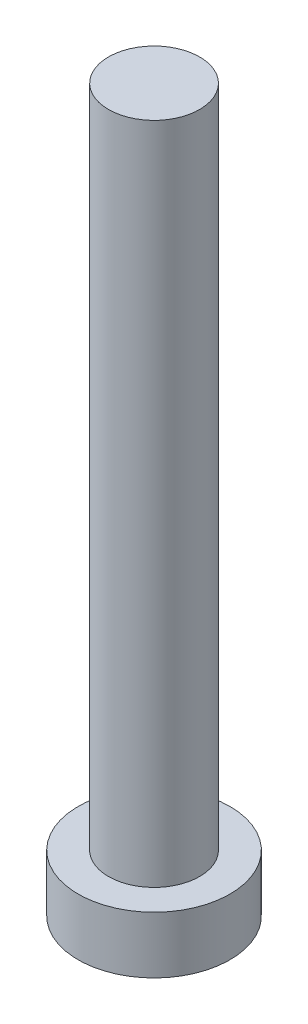
ISO-10303-21;
HEADER;
FILE_DESCRIPTION(('STEP AP214'),'2;1');
FILE_NAME('part.step','',(''),(''),'','','');
FILE_SCHEMA(('AUTOMOTIVE_DESIGN { 1 0 10303 214 1 1 1 1 }'));
ENDSEC;
DATA;
#1=APPLICATION_CONTEXT('core data for automotive mechanical design processes');
#2=APPLICATION_PROTOCOL_DEFINITION('international standard','automotive_design',2000,#1);
#3=PRODUCT_CONTEXT('',#1,'mechanical');
#4=PRODUCT('Part','Part','',(#3));
#5=PRODUCT_RELATED_PRODUCT_CATEGORY('part','',(#4));
#6=PRODUCT_DEFINITION_FORMATION('','',#4);
#7=PRODUCT_DEFINITION_CONTEXT('part definition',#1,'design');
#8=PRODUCT_DEFINITION('design','',#6,#7);
#9=PRODUCT_DEFINITION_SHAPE('','',#8);
#10=(LENGTH_UNIT() NAMED_UNIT(*) SI_UNIT(.MILLI.,.METRE.));
#11=(NAMED_UNIT(*) PLANE_ANGLE_UNIT() SI_UNIT($,.RADIAN.));
#12=(NAMED_UNIT(*) SI_UNIT($,.STERADIAN.) SOLID_ANGLE_UNIT());
#13=UNCERTAINTY_MEASURE_WITH_UNIT(LENGTH_MEASURE(1.E-05),#10,'distance_accuracy_value','');
#14=(GEOMETRIC_REPRESENTATION_CONTEXT(3) GLOBAL_UNCERTAINTY_ASSIGNED_CONTEXT((#13)) GLOBAL_UNIT_ASSIGNED_CONTEXT((#10,
#11,#12)) REPRESENTATION_CONTEXT('',''));
#15=CARTESIAN_POINT('',(0.,0.,0.));
#16=DIRECTION('',(0.,0.,1.));
#17=DIRECTION('',(1.,0.,0.));
#18=AXIS2_PLACEMENT_3D('',#15,#16,#17);
#19=CARTESIAN_POINT('',(0.,44.45,0.));
#20=DIRECTION('',(0.,-1.,0.));
#21=DIRECTION('',(0.,0.,-1.));
#22=AXIS2_PLACEMENT_3D('',#19,#20,#21);
#23=CYLINDRICAL_SURFACE('',#22,3.048);
#24=CARTESIAN_POINT('',(0.,44.45,0.));
#25=DIRECTION('',(0.,1.,0.));
#26=DIRECTION('',(0.,0.,1.));
#27=AXIS2_PLACEMENT_3D('',#24,#25,#26);
#28=CIRCLE('',#27,3.048);
#29=CARTESIAN_POINT('',(0.,44.45,3.048));
#30=VERTEX_POINT('',#29);
#31=EDGE_CURVE('E10',#30,#30,#28,.T.);
#32=ORIENTED_EDGE('',*,*,#31,.F.);
#33=EDGE_LOOP('',(#32));
#34=FACE_BOUND('',#33,.T.);
#35=CARTESIAN_POINT('',(0.,0.,0.));
#36=DIRECTION('',(0.,1.,0.));
#37=DIRECTION('',(0.,0.,1.));
#38=AXIS2_PLACEMENT_3D('',#35,#36,#37);
#39=CIRCLE('',#38,3.048);
#40=CARTESIAN_POINT('',(0.,0.,3.048));
#41=VERTEX_POINT('',#40);
#42=EDGE_CURVE('E34',#41,#41,#39,.T.);
#43=ORIENTED_EDGE('',*,*,#42,.T.);
#44=EDGE_LOOP('',(#43));
#45=FACE_BOUND('',#44,.T.);
#46=ADVANCED_FACE('F31',(#34,#45),#23,.T.);
#47=CARTESIAN_POINT('',(0.,44.45,0.));
#48=DIRECTION('',(0.,1.,0.));
#49=DIRECTION('',(0.,0.,1.));
#50=AXIS2_PLACEMENT_3D('',#47,#48,#49);
#51=PLANE('',#50);
#52=ORIENTED_EDGE('',*,*,#31,.T.);
#53=EDGE_LOOP('',(#52));
#54=FACE_BOUND('',#53,.T.);
#55=ADVANCED_FACE('F54',(#54),#51,.T.);
#56=CARTESIAN_POINT('',(0.,-3.81,0.));
#57=DIRECTION('',(0.,1.,0.));
#58=DIRECTION('',(0.,0.,1.));
#59=AXIS2_PLACEMENT_3D('',#56,#57,#58);
#60=CYLINDRICAL_SURFACE('',#59,5.08);
#61=CARTESIAN_POINT('',(0.,-3.81,0.));
#62=DIRECTION('',(0.,-1.,0.));
#63=DIRECTION('',(0.,0.,-1.));
#64=AXIS2_PLACEMENT_3D('',#61,#62,#63);
#65=CIRCLE('',#64,5.08);
#66=CARTESIAN_POINT('',(0.,-3.81,-5.08));
#67=VERTEX_POINT('',#66);
#68=EDGE_CURVE('E41',#67,#67,#65,.T.);
#69=ORIENTED_EDGE('',*,*,#68,.F.);
#70=EDGE_LOOP('',(#69));
#71=FACE_BOUND('',#70,.T.);
#72=CARTESIAN_POINT('',(0.,0.,0.));
#73=DIRECTION('',(0.,-1.,0.));
#74=DIRECTION('',(0.,0.,-1.));
#75=AXIS2_PLACEMENT_3D('',#72,#73,#74);
#76=CIRCLE('',#75,5.08);
#77=CARTESIAN_POINT('',(0.,0.,-5.08));
#78=VERTEX_POINT('',#77);
#79=EDGE_CURVE('E43',#78,#78,#76,.T.);
#80=ORIENTED_EDGE('',*,*,#79,.T.);
#81=EDGE_LOOP('',(#80));
#82=FACE_BOUND('',#81,.T.);
#83=ADVANCED_FACE('F51',(#71,#82),#60,.T.);
#84=CARTESIAN_POINT('',(0.,-3.81,0.));
#85=DIRECTION('',(0.,-1.,0.));
#86=DIRECTION('',(0.,0.,-1.));
#87=AXIS2_PLACEMENT_3D('',#84,#85,#86);
#88=PLANE('',#87);
#89=ORIENTED_EDGE('',*,*,#68,.T.);
#90=EDGE_LOOP('',(#89));
#91=FACE_BOUND('',#90,.T.);
#92=ADVANCED_FACE('F49',(#91),#88,.T.);
#93=CARTESIAN_POINT('',(0.,0.,0.));
#94=DIRECTION('',(0.,-1.,0.));
#95=DIRECTION('',(0.,0.,-1.));
#96=AXIS2_PLACEMENT_3D('',#93,#94,#95);
#97=PLANE('',#96);
#98=ORIENTED_EDGE('',*,*,#42,.F.);
#99=EDGE_LOOP('',(#98));
#100=FACE_BOUND('',#99,.T.);
#101=ORIENTED_EDGE('',*,*,#79,.F.);
#102=EDGE_LOOP('',(#101));
#103=FACE_BOUND('',#102,.T.);
#104=ADVANCED_FACE('F58',(#100,#103),#97,.F.);
#105=CLOSED_SHELL('',(#46,#55,#83,#92,#104));
#106=MANIFOLD_SOLID_BREP('B2',#105);
#107=ADVANCED_BREP_SHAPE_REPRESENTATION('',(#18,#106),#14);
#108=SHAPE_DEFINITION_REPRESENTATION(#9,#107);
ENDSEC;
END-ISO-10303-21;
